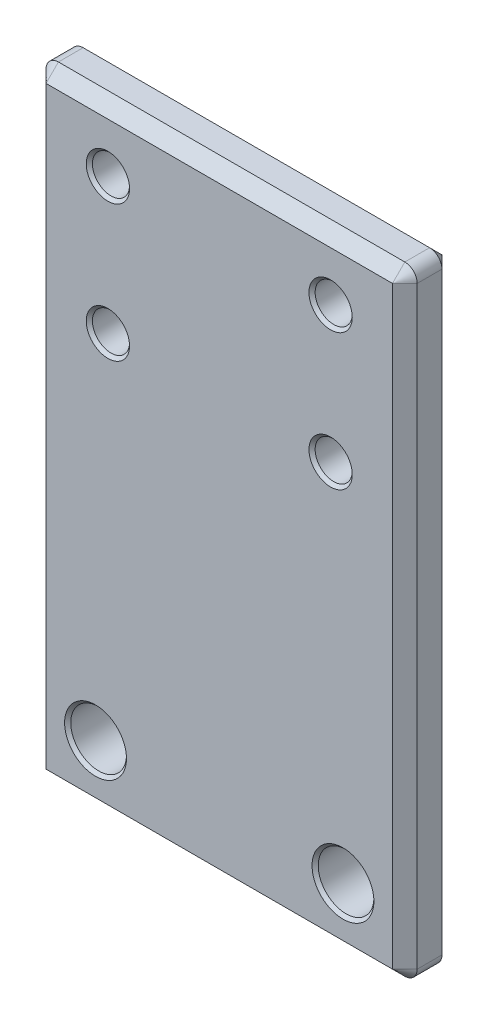
ISO-10303-21;
HEADER;
FILE_DESCRIPTION(('STEP AP214'),'2;1');
FILE_NAME('part.step','',(''),(''),'','','');
FILE_SCHEMA(('AUTOMOTIVE_DESIGN { 1 0 10303 214 1 1 1 1 }'));
ENDSEC;
DATA;
#1=APPLICATION_CONTEXT('core data for automotive mechanical design processes');
#2=APPLICATION_PROTOCOL_DEFINITION('international standard','automotive_design',2000,#1);
#3=PRODUCT_CONTEXT('',#1,'mechanical');
#4=PRODUCT('Part','Part','',(#3));
#5=PRODUCT_RELATED_PRODUCT_CATEGORY('part','',(#4));
#6=PRODUCT_DEFINITION_FORMATION('','',#4);
#7=PRODUCT_DEFINITION_CONTEXT('part definition',#1,'design');
#8=PRODUCT_DEFINITION('design','',#6,#7);
#9=PRODUCT_DEFINITION_SHAPE('','',#8);
#10=(LENGTH_UNIT() NAMED_UNIT(*) SI_UNIT(.MILLI.,.METRE.));
#11=(NAMED_UNIT(*) PLANE_ANGLE_UNIT() SI_UNIT($,.RADIAN.));
#12=(NAMED_UNIT(*) SI_UNIT($,.STERADIAN.) SOLID_ANGLE_UNIT());
#13=UNCERTAINTY_MEASURE_WITH_UNIT(LENGTH_MEASURE(1.E-05),#10,'distance_accuracy_value','');
#14=(GEOMETRIC_REPRESENTATION_CONTEXT(3) GLOBAL_UNCERTAINTY_ASSIGNED_CONTEXT((#13)) GLOBAL_UNIT_ASSIGNED_CONTEXT((#10,
#11,#12)) REPRESENTATION_CONTEXT('',''));
#15=CARTESIAN_POINT('',(0.,0.,0.));
#16=DIRECTION('',(0.,0.,1.));
#17=DIRECTION('',(1.,0.,0.));
#18=AXIS2_PLACEMENT_3D('',#15,#16,#17);
#19=CARTESIAN_POINT('',(15.,-39.5,4.));
#20=DIRECTION('',(-1.,0.,0.));
#21=DIRECTION('',(0.,0.,1.));
#22=AXIS2_PLACEMENT_3D('',#19,#20,#21);
#23=PLANE('',#22);
#24=DIRECTION('',(0.,0.,-1.));
#25=VECTOR('',#24,1.);
#26=CARTESIAN_POINT('',(15.,-38.5,4.));
#27=LINE('',#26,#25);
#28=CARTESIAN_POINT('',(15.,-38.5,3.));
#29=VERTEX_POINT('',#28);
#30=CARTESIAN_POINT('',(15.,-38.5,1.));
#31=VERTEX_POINT('',#30);
#32=EDGE_CURVE('E329',#29,#31,#27,.T.);
#33=ORIENTED_EDGE('',*,*,#32,.T.);
#34=DIRECTION('',(0.,1.,0.));
#35=VECTOR('',#34,1.);
#36=CARTESIAN_POINT('',(15.,9.49999999999999,1.));
#37=LINE('',#36,#35);
#38=CARTESIAN_POINT('',(15.,9.49999999999999,1.));
#39=VERTEX_POINT('',#38);
#40=EDGE_CURVE('E219',#31,#39,#37,.T.);
#41=ORIENTED_EDGE('',*,*,#40,.T.);
#42=DIRECTION('',(0.,0.,-1.));
#43=VECTOR('',#42,1.);
#44=CARTESIAN_POINT('',(15.,9.49999999999999,4.));
#45=LINE('',#44,#43);
#46=CARTESIAN_POINT('',(15.,9.49999999999999,3.));
#47=VERTEX_POINT('',#46);
#48=EDGE_CURVE('E190',#39,#47,#45,.F.);
#49=ORIENTED_EDGE('',*,*,#48,.T.);
#50=DIRECTION('',(0.,-1.,0.));
#51=VECTOR('',#50,1.);
#52=CARTESIAN_POINT('',(15.,-39.5,3.));
#53=LINE('',#52,#51);
#54=EDGE_CURVE('E216',#47,#29,#53,.T.);
#55=ORIENTED_EDGE('',*,*,#54,.T.);
#56=EDGE_LOOP('',(#33,#41,#49,#55));
#57=FACE_BOUND('',#56,.T.);
#58=ADVANCED_FACE('F47',(#57),#23,.F.);
#59=CARTESIAN_POINT('',(-15.,10.5,4.));
#60=DIRECTION('',(0.,-1.,0.));
#61=DIRECTION('',(0.,0.,-1.));
#62=AXIS2_PLACEMENT_3D('',#59,#60,#61);
#63=PLANE('',#62);
#64=DIRECTION('',(0.,0.,-1.));
#65=VECTOR('',#64,1.);
#66=CARTESIAN_POINT('',(14.,10.5,4.));
#67=LINE('',#66,#65);
#68=CARTESIAN_POINT('',(14.,10.5,3.));
#69=VERTEX_POINT('',#68);
#70=CARTESIAN_POINT('',(14.,10.5,1.));
#71=VERTEX_POINT('',#70);
#72=EDGE_CURVE('E319',#69,#71,#67,.T.);
#73=ORIENTED_EDGE('',*,*,#72,.T.);
#74=DIRECTION('',(-1.,0.,0.));
#75=VECTOR('',#74,1.);
#76=CARTESIAN_POINT('',(-14.,10.5,1.));
#77=LINE('',#76,#75);
#78=CARTESIAN_POINT('',(-14.,10.5,1.));
#79=VERTEX_POINT('',#78);
#80=EDGE_CURVE('E243',#71,#79,#77,.T.);
#81=ORIENTED_EDGE('',*,*,#80,.T.);
#82=DIRECTION('',(0.,0.,-1.));
#83=VECTOR('',#82,1.);
#84=CARTESIAN_POINT('',(-14.,10.5,4.));
#85=LINE('',#84,#83);
#86=CARTESIAN_POINT('',(-14.,10.5,3.));
#87=VERTEX_POINT('',#86);
#88=EDGE_CURVE('E322',#79,#87,#85,.F.);
#89=ORIENTED_EDGE('',*,*,#88,.T.);
#90=DIRECTION('',(1.,0.,0.));
#91=VECTOR('',#90,1.);
#92=CARTESIAN_POINT('',(-15.,10.5,3.));
#93=LINE('',#92,#91);
#94=EDGE_CURVE('E240',#87,#69,#93,.T.);
#95=ORIENTED_EDGE('',*,*,#94,.T.);
#96=EDGE_LOOP('',(#73,#81,#89,#95));
#97=FACE_BOUND('',#96,.T.);
#98=ADVANCED_FACE('F318',(#97),#63,.F.);
#99=CARTESIAN_POINT('',(-15.,-39.5,4.));
#100=DIRECTION('',(1.,0.,0.));
#101=DIRECTION('',(0.,0.,-1.));
#102=AXIS2_PLACEMENT_3D('',#99,#100,#101);
#103=PLANE('',#102);
#104=DIRECTION('',(0.,0.,-1.));
#105=VECTOR('',#104,1.);
#106=CARTESIAN_POINT('',(-15.,9.49999999999999,4.));
#107=LINE('',#106,#105);
#108=CARTESIAN_POINT('',(-15.,9.49999999999999,3.));
#109=VERTEX_POINT('',#108);
#110=CARTESIAN_POINT('',(-15.,9.49999999999999,1.));
#111=VERTEX_POINT('',#110);
#112=EDGE_CURVE('E183',#109,#111,#107,.T.);
#113=ORIENTED_EDGE('',*,*,#112,.T.);
#114=DIRECTION('',(0.,-1.,0.));
#115=VECTOR('',#114,1.);
#116=CARTESIAN_POINT('',(-15.,-38.5,1.));
#117=LINE('',#116,#115);
#118=CARTESIAN_POINT('',(-15.,-38.5,1.));
#119=VERTEX_POINT('',#118);
#120=EDGE_CURVE('E225',#111,#119,#117,.T.);
#121=ORIENTED_EDGE('',*,*,#120,.T.);
#122=DIRECTION('',(0.,0.,-1.));
#123=VECTOR('',#122,1.);
#124=CARTESIAN_POINT('',(-15.,-38.5,4.));
#125=LINE('',#124,#123);
#126=CARTESIAN_POINT('',(-15.,-38.5,3.));
#127=VERTEX_POINT('',#126);
#128=EDGE_CURVE('E188',#119,#127,#125,.F.);
#129=ORIENTED_EDGE('',*,*,#128,.T.);
#130=DIRECTION('',(0.,1.,0.));
#131=VECTOR('',#130,1.);
#132=CARTESIAN_POINT('',(-15.,-39.5,3.));
#133=LINE('',#132,#131);
#134=EDGE_CURVE('E222',#127,#109,#133,.T.);
#135=ORIENTED_EDGE('',*,*,#134,.T.);
#136=EDGE_LOOP('',(#113,#121,#129,#135));
#137=FACE_BOUND('',#136,.T.);
#138=ADVANCED_FACE('F366',(#137),#103,.F.);
#139=CARTESIAN_POINT('',(-15.,-39.5,4.));
#140=DIRECTION('',(0.,1.,0.));
#141=DIRECTION('',(0.,0.,1.));
#142=AXIS2_PLACEMENT_3D('',#139,#140,#141);
#143=PLANE('',#142);
#144=DIRECTION('',(0.,0.,-1.));
#145=VECTOR('',#144,1.);
#146=CARTESIAN_POINT('',(-14.,-39.5,4.));
#147=LINE('',#146,#145);
#148=CARTESIAN_POINT('',(-14.,-39.5,3.));
#149=VERTEX_POINT('',#148);
#150=CARTESIAN_POINT('',(-14.,-39.5,1.));
#151=VERTEX_POINT('',#150);
#152=EDGE_CURVE('E174',#149,#151,#147,.T.);
#153=ORIENTED_EDGE('',*,*,#152,.T.);
#154=DIRECTION('',(1.,0.,0.));
#155=VECTOR('',#154,1.);
#156=CARTESIAN_POINT('',(14.,-39.5,1.));
#157=LINE('',#156,#155);
#158=CARTESIAN_POINT('',(14.,-39.5,1.));
#159=VERTEX_POINT('',#158);
#160=EDGE_CURVE('E147',#151,#159,#157,.T.);
#161=ORIENTED_EDGE('',*,*,#160,.T.);
#162=DIRECTION('',(0.,0.,-1.));
#163=VECTOR('',#162,1.);
#164=CARTESIAN_POINT('',(14.,-39.5,4.));
#165=LINE('',#164,#163);
#166=CARTESIAN_POINT('',(14.,-39.5,3.));
#167=VERTEX_POINT('',#166);
#168=EDGE_CURVE('E172',#159,#167,#165,.F.);
#169=ORIENTED_EDGE('',*,*,#168,.T.);
#170=DIRECTION('',(-1.,0.,0.));
#171=VECTOR('',#170,1.);
#172=CARTESIAN_POINT('',(-15.,-39.5,3.));
#173=LINE('',#172,#171);
#174=EDGE_CURVE('E178',#167,#149,#173,.T.);
#175=ORIENTED_EDGE('',*,*,#174,.T.);
#176=EDGE_LOOP('',(#153,#161,#169,#175));
#177=FACE_BOUND('',#176,.T.);
#178=ADVANCED_FACE('F170',(#177),#143,.F.);
#179=CARTESIAN_POINT('',(0.,0.,4.));
#180=DIRECTION('',(0.,0.,-1.));
#181=DIRECTION('',(-1.,0.,0.));
#182=AXIS2_PLACEMENT_3D('',#179,#180,#181);
#183=PLANE('',#182);
#184=DIRECTION('',(0.,-1.,0.));
#185=VECTOR('',#184,1.);
#186=CARTESIAN_POINT('',(-14.,0.,4.));
#187=LINE('',#186,#185);
#188=CARTESIAN_POINT('',(-14.,9.50000000000001,4.));
#189=VERTEX_POINT('',#188);
#190=CARTESIAN_POINT('',(-14.,-38.5,4.));
#191=VERTEX_POINT('',#190);
#192=EDGE_CURVE('E73',#189,#191,#187,.T.);
#193=ORIENTED_EDGE('',*,*,#192,.T.);
#194=DIRECTION('',(1.,0.,0.));
#195=VECTOR('',#194,1.);
#196=CARTESIAN_POINT('',(0.,-38.5,4.));
#197=LINE('',#196,#195);
#198=CARTESIAN_POINT('',(14.,-38.5,4.));
#199=VERTEX_POINT('',#198);
#200=EDGE_CURVE('E11',#191,#199,#197,.T.);
#201=ORIENTED_EDGE('',*,*,#200,.T.);
#202=DIRECTION('',(0.,1.,0.));
#203=VECTOR('',#202,1.);
#204=CARTESIAN_POINT('',(14.,0.,4.));
#205=LINE('',#204,#203);
#206=CARTESIAN_POINT('',(14.,9.50000000000001,4.));
#207=VERTEX_POINT('',#206);
#208=EDGE_CURVE('E58',#199,#207,#205,.T.);
#209=ORIENTED_EDGE('',*,*,#208,.T.);
#210=DIRECTION('',(-1.,0.,0.));
#211=VECTOR('',#210,1.);
#212=CARTESIAN_POINT('',(0.,9.50000000000001,4.));
#213=LINE('',#212,#211);
#214=EDGE_CURVE('E246',#207,#189,#213,.T.);
#215=ORIENTED_EDGE('',*,*,#214,.T.);
#216=EDGE_LOOP('',(#193,#201,#209,#215));
#217=FACE_BOUND('',#216,.T.);
#218=CARTESIAN_POINT('',(-10.,-34.5,4.));
#219=DIRECTION('',(0.,0.,1.));
#220=DIRECTION('',(1.,0.,0.));
#221=AXIS2_PLACEMENT_3D('',#218,#219,#220);
#222=CIRCLE('',#221,2.5);
#223=CARTESIAN_POINT('',(-7.5,-34.5,4.));
#224=VERTEX_POINT('',#223);
#225=EDGE_CURVE('E796',#224,#224,#222,.T.);
#226=ORIENTED_EDGE('',*,*,#225,.F.);
#227=EDGE_LOOP('',(#226));
#228=FACE_BOUND('',#227,.T.);
#229=CARTESIAN_POINT('',(10.,-34.5,4.));
#230=DIRECTION('',(0.,0.,1.));
#231=DIRECTION('',(1.,0.,0.));
#232=AXIS2_PLACEMENT_3D('',#229,#230,#231);
#233=CIRCLE('',#232,2.5);
#234=CARTESIAN_POINT('',(12.5,-34.5,4.));
#235=VERTEX_POINT('',#234);
#236=EDGE_CURVE('E800',#235,#235,#233,.T.);
#237=ORIENTED_EDGE('',*,*,#236,.F.);
#238=EDGE_LOOP('',(#237));
#239=FACE_BOUND('',#238,.T.);
#240=CARTESIAN_POINT('',(-9.,5.5,4.));
#241=DIRECTION('',(0.,0.,1.));
#242=DIRECTION('',(1.,0.,0.));
#243=AXIS2_PLACEMENT_3D('',#240,#241,#242);
#244=CIRCLE('',#243,1.75);
#245=CARTESIAN_POINT('',(-7.25,5.5,4.));
#246=VERTEX_POINT('',#245);
#247=EDGE_CURVE('E804',#246,#246,#244,.T.);
#248=ORIENTED_EDGE('',*,*,#247,.F.);
#249=EDGE_LOOP('',(#248));
#250=FACE_BOUND('',#249,.T.);
#251=CARTESIAN_POINT('',(-9.,-5.5,4.));
#252=DIRECTION('',(0.,0.,1.));
#253=DIRECTION('',(1.,0.,0.));
#254=AXIS2_PLACEMENT_3D('',#251,#252,#253);
#255=CIRCLE('',#254,1.75);
#256=CARTESIAN_POINT('',(-7.25,-5.5,4.));
#257=VERTEX_POINT('',#256);
#258=EDGE_CURVE('E808',#257,#257,#255,.T.);
#259=ORIENTED_EDGE('',*,*,#258,.F.);
#260=EDGE_LOOP('',(#259));
#261=FACE_BOUND('',#260,.T.);
#262=CARTESIAN_POINT('',(9.,-5.5,4.));
#263=DIRECTION('',(0.,0.,1.));
#264=DIRECTION('',(1.,0.,0.));
#265=AXIS2_PLACEMENT_3D('',#262,#263,#264);
#266=CIRCLE('',#265,1.75);
#267=CARTESIAN_POINT('',(10.75,-5.5,4.));
#268=VERTEX_POINT('',#267);
#269=EDGE_CURVE('E812',#268,#268,#266,.T.);
#270=ORIENTED_EDGE('',*,*,#269,.F.);
#271=EDGE_LOOP('',(#270));
#272=FACE_BOUND('',#271,.T.);
#273=CARTESIAN_POINT('',(9.,5.5,4.));
#274=DIRECTION('',(0.,0.,1.));
#275=DIRECTION('',(1.,0.,0.));
#276=AXIS2_PLACEMENT_3D('',#273,#274,#275);
#277=CIRCLE('',#276,1.75);
#278=CARTESIAN_POINT('',(10.75,5.5,4.));
#279=VERTEX_POINT('',#278);
#280=EDGE_CURVE('E815',#279,#279,#277,.T.);
#281=ORIENTED_EDGE('',*,*,#280,.F.);
#282=EDGE_LOOP('',(#281));
#283=FACE_BOUND('',#282,.T.);
#284=ADVANCED_FACE('F537',(#217,#228,#239,#250,#261,#272,#283),#183,.F.);
#285=CARTESIAN_POINT('',(0.,0.,0.));
#286=DIRECTION('',(0.,0.,-1.));
#287=DIRECTION('',(-1.,0.,0.));
#288=AXIS2_PLACEMENT_3D('',#285,#286,#287);
#289=PLANE('',#288);
#290=DIRECTION('',(0.,-1.,0.));
#291=VECTOR('',#290,1.);
#292=CARTESIAN_POINT('',(14.,-38.5,0.));
#293=LINE('',#292,#291);
#294=CARTESIAN_POINT('',(14.,9.5,0.));
#295=VERTEX_POINT('',#294);
#296=CARTESIAN_POINT('',(14.,-38.5,0.));
#297=VERTEX_POINT('',#296);
#298=EDGE_CURVE('E204',#295,#297,#293,.T.);
#299=ORIENTED_EDGE('',*,*,#298,.T.);
#300=DIRECTION('',(-1.,0.,0.));
#301=VECTOR('',#300,1.);
#302=CARTESIAN_POINT('',(-14.,-38.5,0.));
#303=LINE('',#302,#301);
#304=CARTESIAN_POINT('',(-14.,-38.5,0.));
#305=VERTEX_POINT('',#304);
#306=EDGE_CURVE('E149',#297,#305,#303,.T.);
#307=ORIENTED_EDGE('',*,*,#306,.T.);
#308=DIRECTION('',(0.,1.,0.));
#309=VECTOR('',#308,1.);
#310=CARTESIAN_POINT('',(-14.,9.49999999999999,0.));
#311=LINE('',#310,#309);
#312=CARTESIAN_POINT('',(-14.,9.5,0.));
#313=VERTEX_POINT('',#312);
#314=EDGE_CURVE('E201',#305,#313,#311,.T.);
#315=ORIENTED_EDGE('',*,*,#314,.T.);
#316=DIRECTION('',(1.,0.,0.));
#317=VECTOR('',#316,1.);
#318=CARTESIAN_POINT('',(14.,9.5,0.));
#319=LINE('',#318,#317);
#320=EDGE_CURVE('E177',#313,#295,#319,.T.);
#321=ORIENTED_EDGE('',*,*,#320,.T.);
#322=EDGE_LOOP('',(#299,#307,#315,#321));
#323=FACE_BOUND('',#322,.T.);
#324=CARTESIAN_POINT('',(-10.,-34.5,0.));
#325=DIRECTION('',(0.,0.,1.));
#326=DIRECTION('',(1.,0.,0.));
#327=AXIS2_PLACEMENT_3D('',#324,#325,#326);
#328=CIRCLE('',#327,2.5);
#329=CARTESIAN_POINT('',(-7.5,-34.5,0.));
#330=VERTEX_POINT('',#329);
#331=EDGE_CURVE('E277',#330,#330,#328,.T.);
#332=ORIENTED_EDGE('',*,*,#331,.T.);
#333=EDGE_LOOP('',(#332));
#334=FACE_BOUND('',#333,.T.);
#335=CARTESIAN_POINT('',(10.,-34.5,0.));
#336=DIRECTION('',(0.,0.,1.));
#337=DIRECTION('',(1.,0.,0.));
#338=AXIS2_PLACEMENT_3D('',#335,#336,#337);
#339=CIRCLE('',#338,2.5);
#340=CARTESIAN_POINT('',(12.5,-34.5,0.));
#341=VERTEX_POINT('',#340);
#342=EDGE_CURVE('E886',#341,#341,#339,.T.);
#343=ORIENTED_EDGE('',*,*,#342,.T.);
#344=EDGE_LOOP('',(#343));
#345=FACE_BOUND('',#344,.T.);
#346=CARTESIAN_POINT('',(-9.,5.5,0.));
#347=DIRECTION('',(0.,0.,1.));
#348=DIRECTION('',(1.,0.,0.));
#349=AXIS2_PLACEMENT_3D('',#346,#347,#348);
#350=CIRCLE('',#349,1.75);
#351=CARTESIAN_POINT('',(-7.25,5.5,0.));
#352=VERTEX_POINT('',#351);
#353=EDGE_CURVE('E872',#352,#352,#350,.T.);
#354=ORIENTED_EDGE('',*,*,#353,.T.);
#355=EDGE_LOOP('',(#354));
#356=FACE_BOUND('',#355,.T.);
#357=CARTESIAN_POINT('',(-9.,-5.5,0.));
#358=DIRECTION('',(0.,0.,1.));
#359=DIRECTION('',(1.,0.,0.));
#360=AXIS2_PLACEMENT_3D('',#357,#358,#359);
#361=CIRCLE('',#360,1.75);
#362=CARTESIAN_POINT('',(-7.25,-5.5,0.));
#363=VERTEX_POINT('',#362);
#364=EDGE_CURVE('E858',#363,#363,#361,.T.);
#365=ORIENTED_EDGE('',*,*,#364,.T.);
#366=EDGE_LOOP('',(#365));
#367=FACE_BOUND('',#366,.T.);
#368=CARTESIAN_POINT('',(9.,-5.5,0.));
#369=DIRECTION('',(0.,0.,1.));
#370=DIRECTION('',(1.,0.,0.));
#371=AXIS2_PLACEMENT_3D('',#368,#369,#370);
#372=CIRCLE('',#371,1.75);
#373=CARTESIAN_POINT('',(10.75,-5.5,0.));
#374=VERTEX_POINT('',#373);
#375=EDGE_CURVE('E844',#374,#374,#372,.T.);
#376=ORIENTED_EDGE('',*,*,#375,.T.);
#377=EDGE_LOOP('',(#376));
#378=FACE_BOUND('',#377,.T.);
#379=CARTESIAN_POINT('',(9.,5.5,0.));
#380=DIRECTION('',(0.,0.,1.));
#381=DIRECTION('',(1.,0.,0.));
#382=AXIS2_PLACEMENT_3D('',#379,#380,#381);
#383=CIRCLE('',#382,1.75);
#384=CARTESIAN_POINT('',(10.75,5.5,0.));
#385=VERTEX_POINT('',#384);
#386=EDGE_CURVE('E819',#385,#385,#383,.T.);
#387=ORIENTED_EDGE('',*,*,#386,.T.);
#388=EDGE_LOOP('',(#387));
#389=FACE_BOUND('',#388,.T.);
#390=ADVANCED_FACE('F532',(#323,#334,#345,#356,#367,#378,#389),#289,.T.);
#391=CARTESIAN_POINT('',(9.,5.5,0.250000000000001));
#392=DIRECTION('',(0.,0.,-1.));
#393=DIRECTION('',(-1.,0.,0.));
#394=AXIS2_PLACEMENT_3D('',#391,#392,#393);
#395=CONICAL_SURFACE('',#394,1.5,0.785398163397444);
#396=ORIENTED_EDGE('',*,*,#386,.F.);
#397=EDGE_LOOP('',(#396));
#398=FACE_BOUND('',#397,.T.);
#399=CARTESIAN_POINT('',(9.,5.5,0.250000000000001));
#400=DIRECTION('',(0.,0.,1.));
#401=DIRECTION('',(1.,0.,0.));
#402=AXIS2_PLACEMENT_3D('',#399,#400,#401);
#403=CIRCLE('',#402,1.5);
#404=CARTESIAN_POINT('',(10.5,5.5,0.250000000000001));
#405=VERTEX_POINT('',#404);
#406=EDGE_CURVE('E334',#405,#405,#403,.T.);
#407=ORIENTED_EDGE('',*,*,#406,.T.);
#408=EDGE_LOOP('',(#407));
#409=FACE_BOUND('',#408,.T.);
#410=ADVANCED_FACE('F536',(#398,#409),#395,.F.);
#411=CARTESIAN_POINT('',(9.,5.5,4.));
#412=DIRECTION('',(0.,0.,1.));
#413=DIRECTION('',(1.,0.,0.));
#414=AXIS2_PLACEMENT_3D('',#411,#412,#413);
#415=CYLINDRICAL_SURFACE('',#414,1.5);
#416=ORIENTED_EDGE('',*,*,#406,.F.);
#417=EDGE_LOOP('',(#416));
#418=FACE_BOUND('',#417,.T.);
#419=CARTESIAN_POINT('',(9.,5.5,3.75));
#420=DIRECTION('',(0.,0.,1.));
#421=DIRECTION('',(1.,0.,0.));
#422=AXIS2_PLACEMENT_3D('',#419,#420,#421);
#423=CIRCLE('',#422,1.5);
#424=CARTESIAN_POINT('',(10.5,5.5,3.75));
#425=VERTEX_POINT('',#424);
#426=EDGE_CURVE('E818',#425,#425,#423,.T.);
#427=ORIENTED_EDGE('',*,*,#426,.T.);
#428=EDGE_LOOP('',(#427));
#429=FACE_BOUND('',#428,.T.);
#430=ADVANCED_FACE('F582',(#418,#429),#415,.F.);
#431=CARTESIAN_POINT('',(9.,5.5,4.));
#432=DIRECTION('',(0.,0.,1.));
#433=DIRECTION('',(1.,0.,0.));
#434=AXIS2_PLACEMENT_3D('',#431,#432,#433);
#435=CONICAL_SURFACE('',#434,1.75,0.785398163397443);
#436=ORIENTED_EDGE('',*,*,#426,.F.);
#437=EDGE_LOOP('',(#436));
#438=FACE_BOUND('',#437,.T.);
#439=ORIENTED_EDGE('',*,*,#280,.T.);
#440=EDGE_LOOP('',(#439));
#441=FACE_BOUND('',#440,.T.);
#442=ADVANCED_FACE('F591',(#438,#441),#435,.F.);
#443=CARTESIAN_POINT('',(9.,-5.5,0.250000000000001));
#444=DIRECTION('',(0.,0.,-1.));
#445=DIRECTION('',(-1.,0.,0.));
#446=AXIS2_PLACEMENT_3D('',#443,#444,#445);
#447=CONICAL_SURFACE('',#446,1.5,0.785398163397447);
#448=ORIENTED_EDGE('',*,*,#375,.F.);
#449=EDGE_LOOP('',(#448));
#450=FACE_BOUND('',#449,.T.);
#451=CARTESIAN_POINT('',(9.,-5.5,0.250000000000001));
#452=DIRECTION('',(0.,0.,1.));
#453=DIRECTION('',(1.,0.,0.));
#454=AXIS2_PLACEMENT_3D('',#451,#452,#453);
#455=CIRCLE('',#454,1.5);
#456=CARTESIAN_POINT('',(10.5,-5.5,0.250000000000001));
#457=VERTEX_POINT('',#456);
#458=EDGE_CURVE('E826',#457,#457,#455,.T.);
#459=ORIENTED_EDGE('',*,*,#458,.T.);
#460=EDGE_LOOP('',(#459));
#461=FACE_BOUND('',#460,.T.);
#462=ADVANCED_FACE('F600',(#450,#461),#447,.F.);
#463=CARTESIAN_POINT('',(9.,-5.5,4.));
#464=DIRECTION('',(0.,0.,1.));
#465=DIRECTION('',(1.,0.,0.));
#466=AXIS2_PLACEMENT_3D('',#463,#464,#465);
#467=CYLINDRICAL_SURFACE('',#466,1.5);
#468=ORIENTED_EDGE('',*,*,#458,.F.);
#469=EDGE_LOOP('',(#468));
#470=FACE_BOUND('',#469,.T.);
#471=CARTESIAN_POINT('',(9.,-5.5,3.75));
#472=DIRECTION('',(0.,0.,1.));
#473=DIRECTION('',(1.,0.,0.));
#474=AXIS2_PLACEMENT_3D('',#471,#472,#473);
#475=CIRCLE('',#474,1.5);
#476=CARTESIAN_POINT('',(10.5,-5.5,3.75));
#477=VERTEX_POINT('',#476);
#478=EDGE_CURVE('E838',#477,#477,#475,.T.);
#479=ORIENTED_EDGE('',*,*,#478,.T.);
#480=EDGE_LOOP('',(#479));
#481=FACE_BOUND('',#480,.T.);
#482=ADVANCED_FACE('F609',(#470,#481),#467,.F.);
#483=CARTESIAN_POINT('',(9.,-5.5,4.));
#484=DIRECTION('',(0.,0.,1.));
#485=DIRECTION('',(1.,0.,0.));
#486=AXIS2_PLACEMENT_3D('',#483,#484,#485);
#487=CONICAL_SURFACE('',#486,1.75,0.785398163397443);
#488=ORIENTED_EDGE('',*,*,#478,.F.);
#489=EDGE_LOOP('',(#488));
#490=FACE_BOUND('',#489,.T.);
#491=ORIENTED_EDGE('',*,*,#269,.T.);
#492=EDGE_LOOP('',(#491));
#493=FACE_BOUND('',#492,.T.);
#494=ADVANCED_FACE('F618',(#490,#493),#487,.F.);
#495=CARTESIAN_POINT('',(-9.,-5.5,0.250000000000001));
#496=DIRECTION('',(0.,0.,-1.));
#497=DIRECTION('',(-1.,0.,0.));
#498=AXIS2_PLACEMENT_3D('',#495,#496,#497);
#499=CONICAL_SURFACE('',#498,1.5,0.785398163397446);
#500=ORIENTED_EDGE('',*,*,#364,.F.);
#501=EDGE_LOOP('',(#500));
#502=FACE_BOUND('',#501,.T.);
#503=CARTESIAN_POINT('',(-9.,-5.5,0.250000000000001));
#504=DIRECTION('',(0.,0.,1.));
#505=DIRECTION('',(1.,0.,0.));
#506=AXIS2_PLACEMENT_3D('',#503,#504,#505);
#507=CIRCLE('',#506,1.5);
#508=CARTESIAN_POINT('',(-7.5,-5.5,0.250000000000001));
#509=VERTEX_POINT('',#508);
#510=EDGE_CURVE('E848',#509,#509,#507,.T.);
#511=ORIENTED_EDGE('',*,*,#510,.T.);
#512=EDGE_LOOP('',(#511));
#513=FACE_BOUND('',#512,.T.);
#514=ADVANCED_FACE('F627',(#502,#513),#499,.F.);
#515=CARTESIAN_POINT('',(-9.,-5.5,4.));
#516=DIRECTION('',(0.,0.,1.));
#517=DIRECTION('',(1.,0.,0.));
#518=AXIS2_PLACEMENT_3D('',#515,#516,#517);
#519=CYLINDRICAL_SURFACE('',#518,1.5);
#520=ORIENTED_EDGE('',*,*,#510,.F.);
#521=EDGE_LOOP('',(#520));
#522=FACE_BOUND('',#521,.T.);
#523=CARTESIAN_POINT('',(-9.,-5.5,3.75));
#524=DIRECTION('',(0.,0.,1.));
#525=DIRECTION('',(1.,0.,0.));
#526=AXIS2_PLACEMENT_3D('',#523,#524,#525);
#527=CIRCLE('',#526,1.5);
#528=CARTESIAN_POINT('',(-7.5,-5.5,3.75));
#529=VERTEX_POINT('',#528);
#530=EDGE_CURVE('E852',#529,#529,#527,.T.);
#531=ORIENTED_EDGE('',*,*,#530,.T.);
#532=EDGE_LOOP('',(#531));
#533=FACE_BOUND('',#532,.T.);
#534=ADVANCED_FACE('F636',(#522,#533),#519,.F.);
#535=CARTESIAN_POINT('',(-9.,-5.5,4.));
#536=DIRECTION('',(0.,0.,1.));
#537=DIRECTION('',(1.,0.,0.));
#538=AXIS2_PLACEMENT_3D('',#535,#536,#537);
#539=CONICAL_SURFACE('',#538,1.75,0.785398163397443);
#540=ORIENTED_EDGE('',*,*,#530,.F.);
#541=EDGE_LOOP('',(#540));
#542=FACE_BOUND('',#541,.T.);
#543=ORIENTED_EDGE('',*,*,#258,.T.);
#544=EDGE_LOOP('',(#543));
#545=FACE_BOUND('',#544,.T.);
#546=ADVANCED_FACE('F645',(#542,#545),#539,.F.);
#547=CARTESIAN_POINT('',(-9.,5.5,0.250000000000001));
#548=DIRECTION('',(0.,0.,-1.));
#549=DIRECTION('',(-1.,0.,0.));
#550=AXIS2_PLACEMENT_3D('',#547,#548,#549);
#551=CONICAL_SURFACE('',#550,1.5,0.785398163397446);
#552=ORIENTED_EDGE('',*,*,#353,.F.);
#553=EDGE_LOOP('',(#552));
#554=FACE_BOUND('',#553,.T.);
#555=CARTESIAN_POINT('',(-9.,5.5,0.250000000000001));
#556=DIRECTION('',(0.,0.,1.));
#557=DIRECTION('',(1.,0.,0.));
#558=AXIS2_PLACEMENT_3D('',#555,#556,#557);
#559=CIRCLE('',#558,1.5);
#560=CARTESIAN_POINT('',(-7.5,5.5,0.250000000000001));
#561=VERTEX_POINT('',#560);
#562=EDGE_CURVE('E862',#561,#561,#559,.T.);
#563=ORIENTED_EDGE('',*,*,#562,.T.);
#564=EDGE_LOOP('',(#563));
#565=FACE_BOUND('',#564,.T.);
#566=ADVANCED_FACE('F654',(#554,#565),#551,.F.);
#567=CARTESIAN_POINT('',(-9.,5.5,4.));
#568=DIRECTION('',(0.,0.,1.));
#569=DIRECTION('',(1.,0.,0.));
#570=AXIS2_PLACEMENT_3D('',#567,#568,#569);
#571=CYLINDRICAL_SURFACE('',#570,1.5);
#572=ORIENTED_EDGE('',*,*,#562,.F.);
#573=EDGE_LOOP('',(#572));
#574=FACE_BOUND('',#573,.T.);
#575=CARTESIAN_POINT('',(-9.,5.5,3.75));
#576=DIRECTION('',(0.,0.,1.));
#577=DIRECTION('',(1.,0.,0.));
#578=AXIS2_PLACEMENT_3D('',#575,#576,#577);
#579=CIRCLE('',#578,1.5);
#580=CARTESIAN_POINT('',(-7.5,5.5,3.75));
#581=VERTEX_POINT('',#580);
#582=EDGE_CURVE('E866',#581,#581,#579,.T.);
#583=ORIENTED_EDGE('',*,*,#582,.T.);
#584=EDGE_LOOP('',(#583));
#585=FACE_BOUND('',#584,.T.);
#586=ADVANCED_FACE('F663',(#574,#585),#571,.F.);
#587=CARTESIAN_POINT('',(-9.,5.5,4.));
#588=DIRECTION('',(0.,0.,1.));
#589=DIRECTION('',(1.,0.,0.));
#590=AXIS2_PLACEMENT_3D('',#587,#588,#589);
#591=CONICAL_SURFACE('',#590,1.75,0.785398163397443);
#592=ORIENTED_EDGE('',*,*,#582,.F.);
#593=EDGE_LOOP('',(#592));
#594=FACE_BOUND('',#593,.T.);
#595=ORIENTED_EDGE('',*,*,#247,.T.);
#596=EDGE_LOOP('',(#595));
#597=FACE_BOUND('',#596,.T.);
#598=ADVANCED_FACE('F672',(#594,#597),#591,.F.);
#599=CARTESIAN_POINT('',(10.,-34.5,0.25));
#600=DIRECTION('',(0.,0.,-1.));
#601=DIRECTION('',(-1.,0.,0.));
#602=AXIS2_PLACEMENT_3D('',#599,#600,#601);
#603=CONICAL_SURFACE('',#602,2.25,0.785398163397444);
#604=ORIENTED_EDGE('',*,*,#342,.F.);
#605=EDGE_LOOP('',(#604));
#606=FACE_BOUND('',#605,.T.);
#607=CARTESIAN_POINT('',(10.,-34.5,0.25));
#608=DIRECTION('',(0.,0.,1.));
#609=DIRECTION('',(1.,0.,0.));
#610=AXIS2_PLACEMENT_3D('',#607,#608,#609);
#611=CIRCLE('',#610,2.25);
#612=CARTESIAN_POINT('',(12.25,-34.5,0.25));
#613=VERTEX_POINT('',#612);
#614=EDGE_CURVE('E876',#613,#613,#611,.T.);
#615=ORIENTED_EDGE('',*,*,#614,.T.);
#616=EDGE_LOOP('',(#615));
#617=FACE_BOUND('',#616,.T.);
#618=ADVANCED_FACE('F681',(#606,#617),#603,.F.);
#619=CARTESIAN_POINT('',(10.,-34.5,4.));
#620=DIRECTION('',(0.,0.,1.));
#621=DIRECTION('',(1.,0.,0.));
#622=AXIS2_PLACEMENT_3D('',#619,#620,#621);
#623=CYLINDRICAL_SURFACE('',#622,2.25);
#624=ORIENTED_EDGE('',*,*,#614,.F.);
#625=EDGE_LOOP('',(#624));
#626=FACE_BOUND('',#625,.T.);
#627=CARTESIAN_POINT('',(10.,-34.5,3.75));
#628=DIRECTION('',(0.,0.,1.));
#629=DIRECTION('',(1.,0.,0.));
#630=AXIS2_PLACEMENT_3D('',#627,#628,#629);
#631=CIRCLE('',#630,2.25);
#632=CARTESIAN_POINT('',(12.25,-34.5,3.75));
#633=VERTEX_POINT('',#632);
#634=EDGE_CURVE('E880',#633,#633,#631,.T.);
#635=ORIENTED_EDGE('',*,*,#634,.T.);
#636=EDGE_LOOP('',(#635));
#637=FACE_BOUND('',#636,.T.);
#638=ADVANCED_FACE('F690',(#626,#637),#623,.F.);
#639=CARTESIAN_POINT('',(10.,-34.5,4.));
#640=DIRECTION('',(0.,0.,1.));
#641=DIRECTION('',(1.,0.,0.));
#642=AXIS2_PLACEMENT_3D('',#639,#640,#641);
#643=CONICAL_SURFACE('',#642,2.5,0.785398163397445);
#644=ORIENTED_EDGE('',*,*,#634,.F.);
#645=EDGE_LOOP('',(#644));
#646=FACE_BOUND('',#645,.T.);
#647=ORIENTED_EDGE('',*,*,#236,.T.);
#648=EDGE_LOOP('',(#647));
#649=FACE_BOUND('',#648,.T.);
#650=ADVANCED_FACE('F699',(#646,#649),#643,.F.);
#651=CARTESIAN_POINT('',(-10.,-34.5,0.25));
#652=DIRECTION('',(0.,0.,-1.));
#653=DIRECTION('',(-1.,0.,0.));
#654=AXIS2_PLACEMENT_3D('',#651,#652,#653);
#655=CONICAL_SURFACE('',#654,2.25,0.785398163397446);
#656=ORIENTED_EDGE('',*,*,#331,.F.);
#657=EDGE_LOOP('',(#656));
#658=FACE_BOUND('',#657,.T.);
#659=CARTESIAN_POINT('',(-10.,-34.5,0.25));
#660=DIRECTION('',(0.,0.,1.));
#661=DIRECTION('',(1.,0.,0.));
#662=AXIS2_PLACEMENT_3D('',#659,#660,#661);
#663=CIRCLE('',#662,2.25);
#664=CARTESIAN_POINT('',(-7.75,-34.5,0.25));
#665=VERTEX_POINT('',#664);
#666=EDGE_CURVE('E890',#665,#665,#663,.T.);
#667=ORIENTED_EDGE('',*,*,#666,.T.);
#668=EDGE_LOOP('',(#667));
#669=FACE_BOUND('',#668,.T.);
#670=ADVANCED_FACE('F708',(#658,#669),#655,.F.);
#671=CARTESIAN_POINT('',(-10.,-34.5,4.));
#672=DIRECTION('',(0.,0.,1.));
#673=DIRECTION('',(1.,0.,0.));
#674=AXIS2_PLACEMENT_3D('',#671,#672,#673);
#675=CYLINDRICAL_SURFACE('',#674,2.25);
#676=ORIENTED_EDGE('',*,*,#666,.F.);
#677=EDGE_LOOP('',(#676));
#678=FACE_BOUND('',#677,.T.);
#679=CARTESIAN_POINT('',(-10.,-34.5,3.75));
#680=DIRECTION('',(0.,0.,1.));
#681=DIRECTION('',(1.,0.,0.));
#682=AXIS2_PLACEMENT_3D('',#679,#680,#681);
#683=CIRCLE('',#682,2.25);
#684=CARTESIAN_POINT('',(-7.75,-34.5,3.75));
#685=VERTEX_POINT('',#684);
#686=EDGE_CURVE('E894',#685,#685,#683,.T.);
#687=ORIENTED_EDGE('',*,*,#686,.T.);
#688=EDGE_LOOP('',(#687));
#689=FACE_BOUND('',#688,.T.);
#690=ADVANCED_FACE('F717',(#678,#689),#675,.F.);
#691=CARTESIAN_POINT('',(-10.,-34.5,4.));
#692=DIRECTION('',(0.,0.,1.));
#693=DIRECTION('',(1.,0.,0.));
#694=AXIS2_PLACEMENT_3D('',#691,#692,#693);
#695=CONICAL_SURFACE('',#694,2.5,0.785398163397445);
#696=ORIENTED_EDGE('',*,*,#686,.F.);
#697=EDGE_LOOP('',(#696));
#698=FACE_BOUND('',#697,.T.);
#699=ORIENTED_EDGE('',*,*,#225,.T.);
#700=EDGE_LOOP('',(#699));
#701=FACE_BOUND('',#700,.T.);
#702=ADVANCED_FACE('F372',(#698,#701),#695,.F.);
#703=CARTESIAN_POINT('',(14.,9.5,4.));
#704=DIRECTION('',(0.,0.,-1.));
#705=DIRECTION('',(-1.,0.,0.));
#706=AXIS2_PLACEMENT_3D('',#703,#704,#705);
#707=CYLINDRICAL_SURFACE('',#706,1.);
#708=ORIENTED_EDGE('',*,*,#48,.F.);
#709=CARTESIAN_POINT('',(14.,9.5,1.));
#710=DIRECTION('',(0.,0.,-1.));
#711=DIRECTION('',(-1.,0.,0.));
#712=AXIS2_PLACEMENT_3D('',#709,#710,#711);
#713=CIRCLE('',#712,1.);
#714=EDGE_CURVE('E231',#39,#71,#713,.F.);
#715=ORIENTED_EDGE('',*,*,#714,.T.);
#716=ORIENTED_EDGE('',*,*,#72,.F.);
#717=CARTESIAN_POINT('',(14.,9.5,3.));
#718=DIRECTION('',(0.,0.,-1.));
#719=DIRECTION('',(-1.,0.,0.));
#720=AXIS2_PLACEMENT_3D('',#717,#718,#719);
#721=CIRCLE('',#720,1.);
#722=EDGE_CURVE('E228',#69,#47,#721,.T.);
#723=ORIENTED_EDGE('',*,*,#722,.T.);
#724=EDGE_LOOP('',(#708,#715,#716,#723));
#725=FACE_BOUND('',#724,.T.);
#726=ADVANCED_FACE('F325',(#725),#707,.T.);
#727=CARTESIAN_POINT('',(14.,-38.5,4.));
#728=DIRECTION('',(0.,0.,-1.));
#729=DIRECTION('',(-1.,0.,0.));
#730=AXIS2_PLACEMENT_3D('',#727,#728,#729);
#731=CYLINDRICAL_SURFACE('',#730,1.);
#732=ORIENTED_EDGE('',*,*,#168,.F.);
#733=CARTESIAN_POINT('',(14.,-38.5,1.));
#734=DIRECTION('',(0.,0.,-1.));
#735=DIRECTION('',(-1.,0.,0.));
#736=AXIS2_PLACEMENT_3D('',#733,#734,#735);
#737=CIRCLE('',#736,1.);
#738=EDGE_CURVE('E155',#159,#31,#737,.F.);
#739=ORIENTED_EDGE('',*,*,#738,.T.);
#740=ORIENTED_EDGE('',*,*,#32,.F.);
#741=CARTESIAN_POINT('',(14.,-38.5,3.));
#742=DIRECTION('',(0.,0.,-1.));
#743=DIRECTION('',(-1.,0.,0.));
#744=AXIS2_PLACEMENT_3D('',#741,#742,#743);
#745=CIRCLE('',#744,1.);
#746=EDGE_CURVE('E165',#29,#167,#745,.T.);
#747=ORIENTED_EDGE('',*,*,#746,.T.);
#748=EDGE_LOOP('',(#732,#739,#740,#747));
#749=FACE_BOUND('',#748,.T.);
#750=ADVANCED_FACE('F180',(#749),#731,.T.);
#751=CARTESIAN_POINT('',(-14.,-38.5,4.));
#752=DIRECTION('',(0.,0.,-1.));
#753=DIRECTION('',(-1.,0.,0.));
#754=AXIS2_PLACEMENT_3D('',#751,#752,#753);
#755=CYLINDRICAL_SURFACE('',#754,1.);
#756=ORIENTED_EDGE('',*,*,#128,.F.);
#757=CARTESIAN_POINT('',(-14.,-38.5,1.));
#758=DIRECTION('',(0.,0.,-1.));
#759=DIRECTION('',(-1.,0.,0.));
#760=AXIS2_PLACEMENT_3D('',#757,#758,#759);
#761=CIRCLE('',#760,1.);
#762=EDGE_CURVE('E213',#119,#151,#761,.F.);
#763=ORIENTED_EDGE('',*,*,#762,.T.);
#764=ORIENTED_EDGE('',*,*,#152,.F.);
#765=CARTESIAN_POINT('',(-14.,-38.5,3.));
#766=DIRECTION('',(0.,0.,-1.));
#767=DIRECTION('',(-1.,0.,0.));
#768=AXIS2_PLACEMENT_3D('',#765,#766,#767);
#769=CIRCLE('',#768,1.);
#770=EDGE_CURVE('E164',#149,#127,#769,.T.);
#771=ORIENTED_EDGE('',*,*,#770,.T.);
#772=EDGE_LOOP('',(#756,#763,#764,#771));
#773=FACE_BOUND('',#772,.T.);
#774=ADVANCED_FACE('F375',(#773),#755,.T.);
#775=CARTESIAN_POINT('',(-14.,9.49999999999999,4.));
#776=DIRECTION('',(0.,0.,-1.));
#777=DIRECTION('',(-1.,0.,0.));
#778=AXIS2_PLACEMENT_3D('',#775,#776,#777);
#779=CYLINDRICAL_SURFACE('',#778,1.);
#780=ORIENTED_EDGE('',*,*,#88,.F.);
#781=CARTESIAN_POINT('',(-14.,9.49999999999999,1.));
#782=DIRECTION('',(0.,0.,-1.));
#783=DIRECTION('',(-1.,0.,0.));
#784=AXIS2_PLACEMENT_3D('',#781,#782,#783);
#785=CIRCLE('',#784,1.);
#786=EDGE_CURVE('E237',#79,#111,#785,.F.);
#787=ORIENTED_EDGE('',*,*,#786,.T.);
#788=ORIENTED_EDGE('',*,*,#112,.F.);
#789=CARTESIAN_POINT('',(-14.,9.49999999999999,3.));
#790=DIRECTION('',(0.,0.,-1.));
#791=DIRECTION('',(-1.,0.,0.));
#792=AXIS2_PLACEMENT_3D('',#789,#790,#791);
#793=CIRCLE('',#792,1.);
#794=EDGE_CURVE('E234',#109,#87,#793,.T.);
#795=ORIENTED_EDGE('',*,*,#794,.T.);
#796=EDGE_LOOP('',(#780,#787,#788,#795));
#797=FACE_BOUND('',#796,.T.);
#798=ADVANCED_FACE('F378',(#797),#779,.T.);
#799=CARTESIAN_POINT('',(-15.,10.5,1.));
#800=DIRECTION('',(0.,0.707106781186547,-0.707106781186547));
#801=DIRECTION('',(1.,0.,0.));
#802=AXIS2_PLACEMENT_3D('',#799,#800,#801);
#803=PLANE('',#802);
#804=DIRECTION('',(0.,-0.707106781186547,-0.707106781186547));
#805=VECTOR('',#804,1.);
#806=CARTESIAN_POINT('',(-14.,10.5,1.));
#807=LINE('',#806,#805);
#808=EDGE_CURVE('E273',#79,#313,#807,.T.);
#809=ORIENTED_EDGE('',*,*,#808,.F.);
#810=ORIENTED_EDGE('',*,*,#80,.F.);
#811=DIRECTION('',(0.,0.707106781186547,0.707106781186547));
#812=VECTOR('',#811,1.);
#813=CARTESIAN_POINT('',(14.,9.5,0.));
#814=LINE('',#813,#812);
#815=EDGE_CURVE('E269',#295,#71,#814,.T.);
#816=ORIENTED_EDGE('',*,*,#815,.F.);
#817=ORIENTED_EDGE('',*,*,#320,.F.);
#818=EDGE_LOOP('',(#809,#810,#816,#817));
#819=FACE_BOUND('',#818,.T.);
#820=ADVANCED_FACE('F382',(#819),#803,.T.);
#821=CARTESIAN_POINT('',(-14.,9.49999999999999,1.));
#822=DIRECTION('',(0.,0.,1.));
#823=DIRECTION('',(1.,0.,0.));
#824=AXIS2_PLACEMENT_3D('',#821,#822,#823);
#825=CONICAL_SURFACE('',#824,1.,0.785398163397448);
#826=ORIENTED_EDGE('',*,*,#786,.F.);
#827=ORIENTED_EDGE('',*,*,#808,.T.);
#828=DIRECTION('',(0.707106781186547,0.,-0.707106781186547));
#829=VECTOR('',#828,1.);
#830=CARTESIAN_POINT('',(-15.,9.49999999999999,1.));
#831=LINE('',#830,#829);
#832=EDGE_CURVE('E265',#111,#313,#831,.T.);
#833=ORIENTED_EDGE('',*,*,#832,.F.);
#834=EDGE_LOOP('',(#826,#827,#833));
#835=FACE_BOUND('',#834,.T.);
#836=ADVANCED_FACE('F422',(#835),#825,.T.);
#837=CARTESIAN_POINT('',(14.,9.5,1.));
#838=DIRECTION('',(0.,0.,1.));
#839=DIRECTION('',(1.,0.,0.));
#840=AXIS2_PLACEMENT_3D('',#837,#838,#839);
#841=CONICAL_SURFACE('',#840,1.,0.785398163397448);
#842=ORIENTED_EDGE('',*,*,#815,.T.);
#843=ORIENTED_EDGE('',*,*,#714,.F.);
#844=DIRECTION('',(0.707106781186547,0.,0.707106781186547));
#845=VECTOR('',#844,1.);
#846=CARTESIAN_POINT('',(14.,9.49999999999999,0.));
#847=LINE('',#846,#845);
#848=EDGE_CURVE('E261',#295,#39,#847,.T.);
#849=ORIENTED_EDGE('',*,*,#848,.F.);
#850=EDGE_LOOP('',(#842,#843,#849));
#851=FACE_BOUND('',#850,.T.);
#852=ADVANCED_FACE('F415',(#851),#841,.T.);
#853=CARTESIAN_POINT('',(-15.,-39.5,1.));
#854=DIRECTION('',(-0.707106781186547,0.,-0.707106781186547));
#855=DIRECTION('',(0.,1.,0.));
#856=AXIS2_PLACEMENT_3D('',#853,#854,#855);
#857=PLANE('',#856);
#858=ORIENTED_EDGE('',*,*,#832,.T.);
#859=ORIENTED_EDGE('',*,*,#314,.F.);
#860=DIRECTION('',(0.707106781186547,0.,-0.707106781186547));
#861=VECTOR('',#860,1.);
#862=CARTESIAN_POINT('',(-15.,-38.5,1.));
#863=LINE('',#862,#861);
#864=EDGE_CURVE('E257',#119,#305,#863,.T.);
#865=ORIENTED_EDGE('',*,*,#864,.F.);
#866=ORIENTED_EDGE('',*,*,#120,.F.);
#867=EDGE_LOOP('',(#858,#859,#865,#866));
#868=FACE_BOUND('',#867,.T.);
#869=ADVANCED_FACE('F408',(#868),#857,.T.);
#870=CARTESIAN_POINT('',(15.,-39.5,1.));
#871=DIRECTION('',(0.707106781186547,0.,-0.707106781186547));
#872=DIRECTION('',(0.,-1.,0.));
#873=AXIS2_PLACEMENT_3D('',#870,#871,#872);
#874=PLANE('',#873);
#875=ORIENTED_EDGE('',*,*,#848,.T.);
#876=ORIENTED_EDGE('',*,*,#40,.F.);
#877=DIRECTION('',(0.707106781186547,0.,0.707106781186547));
#878=VECTOR('',#877,1.);
#879=CARTESIAN_POINT('',(14.,-38.5,0.));
#880=LINE('',#879,#878);
#881=EDGE_CURVE('E158',#297,#31,#880,.T.);
#882=ORIENTED_EDGE('',*,*,#881,.F.);
#883=ORIENTED_EDGE('',*,*,#298,.F.);
#884=EDGE_LOOP('',(#875,#876,#882,#883));
#885=FACE_BOUND('',#884,.T.);
#886=ADVANCED_FACE('F401',(#885),#874,.T.);
#887=CARTESIAN_POINT('',(-14.,-38.5,1.));
#888=DIRECTION('',(0.,0.,1.));
#889=DIRECTION('',(1.,0.,0.));
#890=AXIS2_PLACEMENT_3D('',#887,#888,#889);
#891=CONICAL_SURFACE('',#890,1.,0.785398163397448);
#892=ORIENTED_EDGE('',*,*,#762,.F.);
#893=ORIENTED_EDGE('',*,*,#864,.T.);
#894=DIRECTION('',(0.,0.707106781186547,-0.707106781186547));
#895=VECTOR('',#894,1.);
#896=CARTESIAN_POINT('',(-14.,-39.5,1.));
#897=LINE('',#896,#895);
#898=EDGE_CURVE('E153',#151,#305,#897,.T.);
#899=ORIENTED_EDGE('',*,*,#898,.F.);
#900=EDGE_LOOP('',(#892,#893,#899));
#901=FACE_BOUND('',#900,.T.);
#902=ADVANCED_FACE('F395',(#901),#891,.T.);
#903=CARTESIAN_POINT('',(14.,-38.5,1.));
#904=DIRECTION('',(0.,0.,1.));
#905=DIRECTION('',(1.,0.,0.));
#906=AXIS2_PLACEMENT_3D('',#903,#904,#905);
#907=CONICAL_SURFACE('',#906,1.,0.785398163397448);
#908=ORIENTED_EDGE('',*,*,#881,.T.);
#909=ORIENTED_EDGE('',*,*,#738,.F.);
#910=DIRECTION('',(0.,-0.707106781186547,0.707106781186547));
#911=VECTOR('',#910,1.);
#912=CARTESIAN_POINT('',(14.,-38.5,0.));
#913=LINE('',#912,#911);
#914=EDGE_CURVE('E143',#297,#159,#913,.T.);
#915=ORIENTED_EDGE('',*,*,#914,.F.);
#916=EDGE_LOOP('',(#908,#909,#915));
#917=FACE_BOUND('',#916,.T.);
#918=ADVANCED_FACE('F156',(#917),#907,.T.);
#919=CARTESIAN_POINT('',(-15.,-39.5,1.));
#920=DIRECTION('',(0.,-0.707106781186547,-0.707106781186547));
#921=DIRECTION('',(-1.,0.,0.));
#922=AXIS2_PLACEMENT_3D('',#919,#920,#921);
#923=PLANE('',#922);
#924=ORIENTED_EDGE('',*,*,#898,.T.);
#925=ORIENTED_EDGE('',*,*,#306,.F.);
#926=ORIENTED_EDGE('',*,*,#914,.T.);
#927=ORIENTED_EDGE('',*,*,#160,.F.);
#928=EDGE_LOOP('',(#924,#925,#926,#927));
#929=FACE_BOUND('',#928,.T.);
#930=ADVANCED_FACE('F145',(#929),#923,.T.);
#931=CARTESIAN_POINT('',(0.,9.50000000000001,4.));
#932=DIRECTION('',(0.,-0.70710678118655,-0.707106781186545));
#933=DIRECTION('',(-1.,0.,0.));
#934=AXIS2_PLACEMENT_3D('',#931,#932,#933);
#935=PLANE('',#934);
#936=DIRECTION('',(0.,-0.707106781186545,0.70710678118655));
#937=VECTOR('',#936,1.);
#938=CARTESIAN_POINT('',(14.,10.5,3.));
#939=LINE('',#938,#937);
#940=EDGE_CURVE('E297',#69,#207,#939,.T.);
#941=ORIENTED_EDGE('',*,*,#940,.F.);
#942=ORIENTED_EDGE('',*,*,#94,.F.);
#943=DIRECTION('',(0.,0.707106781186545,-0.70710678118655));
#944=VECTOR('',#943,1.);
#945=CARTESIAN_POINT('',(-14.,9.50000000000001,4.));
#946=LINE('',#945,#944);
#947=EDGE_CURVE('E52',#189,#87,#946,.T.);
#948=ORIENTED_EDGE('',*,*,#947,.F.);
#949=ORIENTED_EDGE('',*,*,#214,.F.);
#950=EDGE_LOOP('',(#941,#942,#948,#949));
#951=FACE_BOUND('',#950,.T.);
#952=ADVANCED_FACE('F50',(#951),#935,.F.);
#953=CARTESIAN_POINT('',(-14.,9.49999999999999,3.));
#954=DIRECTION('',(0.,0.,-1.));
#955=DIRECTION('',(-1.,0.,0.));
#956=AXIS2_PLACEMENT_3D('',#953,#954,#955);
#957=CONICAL_SURFACE('',#956,0.999999999999994,0.785398163397445);
#958=ORIENTED_EDGE('',*,*,#947,.T.);
#959=ORIENTED_EDGE('',*,*,#794,.F.);
#960=DIRECTION('',(-0.707106781186545,0.,-0.70710678118655));
#961=VECTOR('',#960,1.);
#962=CARTESIAN_POINT('',(-14.,9.49999999999999,4.));
#963=LINE('',#962,#961);
#964=EDGE_CURVE('E294',#189,#109,#963,.T.);
#965=ORIENTED_EDGE('',*,*,#964,.F.);
#966=EDGE_LOOP('',(#958,#959,#965));
#967=FACE_BOUND('',#966,.T.);
#968=ADVANCED_FACE('F310',(#967),#957,.T.);
#969=CARTESIAN_POINT('',(14.,9.5,3.));
#970=DIRECTION('',(0.,0.,-1.));
#971=DIRECTION('',(-1.,0.,0.));
#972=AXIS2_PLACEMENT_3D('',#969,#970,#971);
#973=CONICAL_SURFACE('',#972,0.999999999999994,0.785398163397445);
#974=ORIENTED_EDGE('',*,*,#722,.F.);
#975=ORIENTED_EDGE('',*,*,#940,.T.);
#976=DIRECTION('',(-0.707106781186545,0.,0.70710678118655));
#977=VECTOR('',#976,1.);
#978=CARTESIAN_POINT('',(15.,9.49999999999999,3.));
#979=LINE('',#978,#977);
#980=EDGE_CURVE('E290',#47,#207,#979,.T.);
#981=ORIENTED_EDGE('',*,*,#980,.F.);
#982=EDGE_LOOP('',(#974,#975,#981));
#983=FACE_BOUND('',#982,.T.);
#984=ADVANCED_FACE('F341',(#983),#973,.T.);
#985=CARTESIAN_POINT('',(-14.,0.,4.));
#986=DIRECTION('',(0.70710678118655,0.,-0.707106781186545));
#987=DIRECTION('',(0.,-1.,0.));
#988=AXIS2_PLACEMENT_3D('',#985,#986,#987);
#989=PLANE('',#988);
#990=ORIENTED_EDGE('',*,*,#964,.T.);
#991=ORIENTED_EDGE('',*,*,#134,.F.);
#992=DIRECTION('',(-0.707106781186545,0.,-0.70710678118655));
#993=VECTOR('',#992,1.);
#994=CARTESIAN_POINT('',(-14.,-38.5,4.));
#995=LINE('',#994,#993);
#996=EDGE_CURVE('E286',#191,#127,#995,.T.);
#997=ORIENTED_EDGE('',*,*,#996,.F.);
#998=ORIENTED_EDGE('',*,*,#192,.F.);
#999=EDGE_LOOP('',(#990,#991,#997,#998));
#1000=FACE_BOUND('',#999,.T.);
#1001=ADVANCED_FACE('F451',(#1000),#989,.F.);
#1002=CARTESIAN_POINT('',(14.,0.,4.));
#1003=DIRECTION('',(-0.70710678118655,0.,-0.707106781186545));
#1004=DIRECTION('',(0.,1.,0.));
#1005=AXIS2_PLACEMENT_3D('',#1002,#1003,#1004);
#1006=PLANE('',#1005);
#1007=ORIENTED_EDGE('',*,*,#980,.T.);
#1008=ORIENTED_EDGE('',*,*,#208,.F.);
#1009=DIRECTION('',(-0.707106781186545,0.,0.70710678118655));
#1010=VECTOR('',#1009,1.);
#1011=CARTESIAN_POINT('',(15.,-38.5,3.));
#1012=LINE('',#1011,#1010);
#1013=EDGE_CURVE('E283',#29,#199,#1012,.T.);
#1014=ORIENTED_EDGE('',*,*,#1013,.F.);
#1015=ORIENTED_EDGE('',*,*,#54,.F.);
#1016=EDGE_LOOP('',(#1007,#1008,#1014,#1015));
#1017=FACE_BOUND('',#1016,.T.);
#1018=ADVANCED_FACE('F345',(#1017),#1006,.F.);
#1019=CARTESIAN_POINT('',(-14.,-38.5,3.));
#1020=DIRECTION('',(0.,0.,-1.));
#1021=DIRECTION('',(-1.,0.,0.));
#1022=AXIS2_PLACEMENT_3D('',#1019,#1020,#1021);
#1023=CONICAL_SURFACE('',#1022,0.999999999999994,0.785398163397445);
#1024=ORIENTED_EDGE('',*,*,#996,.T.);
#1025=ORIENTED_EDGE('',*,*,#770,.F.);
#1026=DIRECTION('',(0.,-0.707106781186545,-0.70710678118655));
#1027=VECTOR('',#1026,1.);
#1028=CARTESIAN_POINT('',(-14.,-38.5,4.));
#1029=LINE('',#1028,#1027);
#1030=EDGE_CURVE('E280',#191,#149,#1029,.T.);
#1031=ORIENTED_EDGE('',*,*,#1030,.F.);
#1032=EDGE_LOOP('',(#1024,#1025,#1031));
#1033=FACE_BOUND('',#1032,.T.);
#1034=ADVANCED_FACE('F350',(#1033),#1023,.T.);
#1035=CARTESIAN_POINT('',(14.,-38.5,3.));
#1036=DIRECTION('',(0.,0.,-1.));
#1037=DIRECTION('',(-1.,0.,0.));
#1038=AXIS2_PLACEMENT_3D('',#1035,#1036,#1037);
#1039=CONICAL_SURFACE('',#1038,0.999999999999994,0.785398163397445);
#1040=ORIENTED_EDGE('',*,*,#746,.F.);
#1041=ORIENTED_EDGE('',*,*,#1013,.T.);
#1042=DIRECTION('',(0.,0.707106781186545,0.70710678118655));
#1043=VECTOR('',#1042,1.);
#1044=CARTESIAN_POINT('',(14.,-39.5,3.));
#1045=LINE('',#1044,#1043);
#1046=EDGE_CURVE('E66',#167,#199,#1045,.T.);
#1047=ORIENTED_EDGE('',*,*,#1046,.F.);
#1048=EDGE_LOOP('',(#1040,#1041,#1047));
#1049=FACE_BOUND('',#1048,.T.);
#1050=ADVANCED_FACE('F347',(#1049),#1039,.T.);
#1051=CARTESIAN_POINT('',(0.,-38.5,4.));
#1052=DIRECTION('',(0.,0.70710678118655,-0.707106781186545));
#1053=DIRECTION('',(1.,0.,0.));
#1054=AXIS2_PLACEMENT_3D('',#1051,#1052,#1053);
#1055=PLANE('',#1054);
#1056=ORIENTED_EDGE('',*,*,#1030,.T.);
#1057=ORIENTED_EDGE('',*,*,#174,.F.);
#1058=ORIENTED_EDGE('',*,*,#1046,.T.);
#1059=ORIENTED_EDGE('',*,*,#200,.F.);
#1060=EDGE_LOOP('',(#1056,#1057,#1058,#1059));
#1061=FACE_BOUND('',#1060,.T.);
#1062=ADVANCED_FACE('F349',(#1061),#1055,.F.);
#1063=CLOSED_SHELL('',(#58,#98,#138,#178,#284,#390,#410,#430,#442,#462,#482,#494,#514,#534,#546,
#566,#586,#598,#618,#638,#650,#670,#690,#702,#726,#750,#774,#798,#820,#836,#852,#869,#886,#902,
#918,#930,#952,#968,#984,#1001,#1018,#1034,#1050,#1062));
#1064=MANIFOLD_SOLID_BREP('B2',#1063);
#1065=ADVANCED_BREP_SHAPE_REPRESENTATION('',(#18,#1064),#14);
#1066=SHAPE_DEFINITION_REPRESENTATION(#9,#1065);
ENDSEC;
END-ISO-10303-21;
